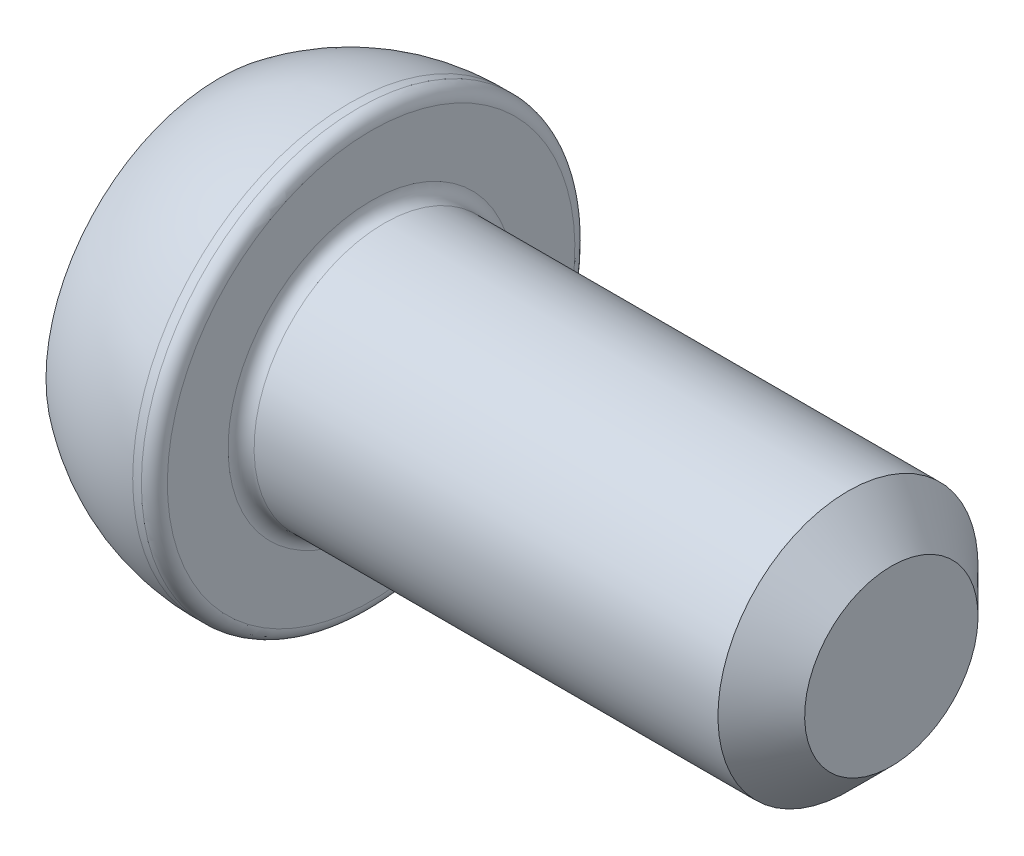
ISO-10303-21;
HEADER;
FILE_DESCRIPTION(('STEP AP214'),'2;1');
FILE_NAME('part.step','',(''),(''),'','','');
FILE_SCHEMA(('AUTOMOTIVE_DESIGN { 1 0 10303 214 1 1 1 1 }'));
ENDSEC;
DATA;
#1=APPLICATION_CONTEXT('core data for automotive mechanical design processes');
#2=APPLICATION_PROTOCOL_DEFINITION('international standard','automotive_design',2000,#1);
#3=PRODUCT_CONTEXT('',#1,'mechanical');
#4=PRODUCT('Part','Part','',(#3));
#5=PRODUCT_RELATED_PRODUCT_CATEGORY('part','',(#4));
#6=PRODUCT_DEFINITION_FORMATION('','',#4);
#7=PRODUCT_DEFINITION_CONTEXT('part definition',#1,'design');
#8=PRODUCT_DEFINITION('design','',#6,#7);
#9=PRODUCT_DEFINITION_SHAPE('','',#8);
#10=(LENGTH_UNIT() NAMED_UNIT(*) SI_UNIT(.MILLI.,.METRE.));
#11=(NAMED_UNIT(*) PLANE_ANGLE_UNIT() SI_UNIT($,.RADIAN.));
#12=(NAMED_UNIT(*) SI_UNIT($,.STERADIAN.) SOLID_ANGLE_UNIT());
#13=UNCERTAINTY_MEASURE_WITH_UNIT(LENGTH_MEASURE(1.E-05),#10,'distance_accuracy_value','');
#14=(GEOMETRIC_REPRESENTATION_CONTEXT(3) GLOBAL_UNCERTAINTY_ASSIGNED_CONTEXT((#13)) GLOBAL_UNIT_ASSIGNED_CONTEXT((#10,
#11,#12)) REPRESENTATION_CONTEXT('',''));
#15=CARTESIAN_POINT('',(0.,0.,0.));
#16=DIRECTION('',(0.,0.,1.));
#17=DIRECTION('',(1.,0.,0.));
#18=AXIS2_PLACEMENT_3D('',#15,#16,#17);
#19=CARTESIAN_POINT('',(0.,0.,0.));
#20=DIRECTION('',(-1.,0.,0.));
#21=DIRECTION('',(0.,-1.,0.));
#22=AXIS2_PLACEMENT_3D('',#19,#20,#21);
#23=PLANE('',#22);
#24=DIRECTION('',(0.,0.866025403784438,-0.5));
#25=VECTOR('',#24,1.);
#26=CARTESIAN_POINT('',(0.,0.,2.3094010767585));
#27=LINE('',#26,#25);
#28=CARTESIAN_POINT('',(0.,0.,2.3094010767585));
#29=VERTEX_POINT('',#28);
#30=CARTESIAN_POINT('',(0.,2.,1.15470053837925));
#31=VERTEX_POINT('',#30);
#32=EDGE_CURVE('E54',#29,#31,#27,.T.);
#33=ORIENTED_EDGE('',*,*,#32,.F.);
#34=DIRECTION('',(0.,0.866025403784439,0.5));
#35=VECTOR('',#34,1.);
#36=CARTESIAN_POINT('',(0.,-2.,1.15470053837925));
#37=LINE('',#36,#35);
#38=CARTESIAN_POINT('',(0.,-2.,1.15470053837925));
#39=VERTEX_POINT('',#38);
#40=EDGE_CURVE('E137',#39,#29,#37,.T.);
#41=ORIENTED_EDGE('',*,*,#40,.F.);
#42=DIRECTION('',(0.,0.,1.));
#43=VECTOR('',#42,1.);
#44=CARTESIAN_POINT('',(0.,-2.,-1.15470053837925));
#45=LINE('',#44,#43);
#46=CARTESIAN_POINT('',(0.,-2.,-1.15470053837925));
#47=VERTEX_POINT('',#46);
#48=EDGE_CURVE('E135',#47,#39,#45,.T.);
#49=ORIENTED_EDGE('',*,*,#48,.F.);
#50=DIRECTION('',(0.,-0.866025403784439,0.5));
#51=VECTOR('',#50,1.);
#52=CARTESIAN_POINT('',(0.,0.,-2.3094010767585));
#53=LINE('',#52,#51);
#54=CARTESIAN_POINT('',(0.,0.,-2.3094010767585));
#55=VERTEX_POINT('',#54);
#56=EDGE_CURVE('E102',#55,#47,#53,.T.);
#57=ORIENTED_EDGE('',*,*,#56,.F.);
#58=DIRECTION('',(0.,-0.866025403784439,-0.5));
#59=VECTOR('',#58,1.);
#60=CARTESIAN_POINT('',(0.,2.,-1.15470053837925));
#61=LINE('',#60,#59);
#62=CARTESIAN_POINT('',(0.,2.,-1.15470053837925));
#63=VERTEX_POINT('',#62);
#64=EDGE_CURVE('E131',#63,#55,#61,.T.);
#65=ORIENTED_EDGE('',*,*,#64,.F.);
#66=DIRECTION('',(0.,0.,-1.));
#67=VECTOR('',#66,1.);
#68=CARTESIAN_POINT('',(0.,2.,1.15470053837925));
#69=LINE('',#68,#67);
#70=EDGE_CURVE('E128',#31,#63,#69,.T.);
#71=ORIENTED_EDGE('',*,*,#70,.F.);
#72=EDGE_LOOP('',(#33,#41,#49,#57,#65,#71));
#73=FACE_BOUND('',#72,.T.);
#74=CARTESIAN_POINT('',(0.,0.,0.));
#75=DIRECTION('',(1.,0.,0.));
#76=DIRECTION('',(0.,1.,0.));
#77=AXIS2_PLACEMENT_3D('',#74,#75,#76);
#78=CIRCLE('',#77,4.);
#79=CARTESIAN_POINT('',(0.,4.,0.));
#80=VERTEX_POINT('',#79);
#81=EDGE_CURVE('E149',#80,#80,#78,.T.);
#82=ORIENTED_EDGE('',*,*,#81,.F.);
#83=EDGE_LOOP('',(#82));
#84=FACE_BOUND('',#83,.T.);
#85=ADVANCED_FACE('F38',(#73,#84),#23,.T.);
#86=CARTESIAN_POINT('',(3.,0.,0.));
#87=DIRECTION('',(1.,0.,0.));
#88=DIRECTION('',(0.,1.,0.));
#89=AXIS2_PLACEMENT_3D('',#86,#87,#88);
#90=SPHERICAL_SURFACE('',#89,5.);
#91=ORIENTED_EDGE('',*,*,#81,.T.);
#92=EDGE_LOOP('',(#91));
#93=FACE_BOUND('',#92,.T.);
#94=CARTESIAN_POINT('',(3.,0.,0.));
#95=DIRECTION('',(1.,0.,0.));
#96=DIRECTION('',(0.,1.,0.));
#97=AXIS2_PLACEMENT_3D('',#94,#95,#96);
#98=CIRCLE('',#97,5.);
#99=CARTESIAN_POINT('',(3.,5.,0.));
#100=VERTEX_POINT('',#99);
#101=EDGE_CURVE('E141',#100,#100,#98,.T.);
#102=ORIENTED_EDGE('',*,*,#101,.F.);
#103=EDGE_LOOP('',(#102));
#104=FACE_BOUND('',#103,.T.);
#105=ADVANCED_FACE('F178',(#93,#104),#90,.T.);
#106=CARTESIAN_POINT('',(15.5,0.,0.));
#107=DIRECTION('',(1.,0.,0.));
#108=DIRECTION('',(0.,1.,0.));
#109=AXIS2_PLACEMENT_3D('',#106,#107,#108);
#110=CYLINDRICAL_SURFACE('',#109,5.);
#111=CARTESIAN_POINT('',(3.2,0.,0.));
#112=DIRECTION('',(1.,0.,0.));
#113=DIRECTION('',(0.,1.,0.));
#114=AXIS2_PLACEMENT_3D('',#111,#112,#113);
#115=CIRCLE('',#114,5.);
#116=CARTESIAN_POINT('',(3.2,5.,0.));
#117=VERTEX_POINT('',#116);
#118=EDGE_CURVE('E161',#117,#117,#115,.F.);
#119=ORIENTED_EDGE('',*,*,#118,.T.);
#120=EDGE_LOOP('',(#119));
#121=FACE_BOUND('',#120,.T.);
#122=ORIENTED_EDGE('',*,*,#101,.T.);
#123=EDGE_LOOP('',(#122));
#124=FACE_BOUND('',#123,.T.);
#125=ADVANCED_FACE('F184',(#121,#124),#110,.T.);
#126=CARTESIAN_POINT('',(3.5,5.,0.));
#127=DIRECTION('',(1.,0.,0.));
#128=DIRECTION('',(0.,1.,0.));
#129=AXIS2_PLACEMENT_3D('',#126,#127,#128);
#130=PLANE('',#129);
#131=CARTESIAN_POINT('',(3.5,0.,0.));
#132=DIRECTION('',(1.,0.,0.));
#133=DIRECTION('',(0.,1.,0.));
#134=AXIS2_PLACEMENT_3D('',#131,#132,#133);
#135=CIRCLE('',#134,3.3);
#136=CARTESIAN_POINT('',(3.5,3.3,0.));
#137=VERTEX_POINT('',#136);
#138=EDGE_CURVE('E158',#137,#137,#135,.F.);
#139=ORIENTED_EDGE('',*,*,#138,.T.);
#140=EDGE_LOOP('',(#139));
#141=FACE_BOUND('',#140,.T.);
#142=CARTESIAN_POINT('',(3.5,0.,0.));
#143=DIRECTION('',(1.,0.,0.));
#144=DIRECTION('',(0.,1.,0.));
#145=AXIS2_PLACEMENT_3D('',#142,#143,#144);
#146=CIRCLE('',#145,4.7);
#147=CARTESIAN_POINT('',(3.5,4.7,0.));
#148=VERTEX_POINT('',#147);
#149=EDGE_CURVE('E155',#148,#148,#146,.T.);
#150=ORIENTED_EDGE('',*,*,#149,.T.);
#151=EDGE_LOOP('',(#150));
#152=FACE_BOUND('',#151,.T.);
#153=ADVANCED_FACE('F203',(#141,#152),#130,.T.);
#154=CARTESIAN_POINT('',(15.5,0.,0.));
#155=DIRECTION('',(1.,0.,0.));
#156=DIRECTION('',(0.,1.,0.));
#157=AXIS2_PLACEMENT_3D('',#154,#155,#156);
#158=CYLINDRICAL_SURFACE('',#157,3.);
#159=CARTESIAN_POINT('',(14.5,0.,0.));
#160=DIRECTION('',(1.,0.,0.));
#161=DIRECTION('',(0.,1.,0.));
#162=AXIS2_PLACEMENT_3D('',#159,#160,#161);
#163=CIRCLE('',#162,3.);
#164=CARTESIAN_POINT('',(14.5,3.,0.));
#165=VERTEX_POINT('',#164);
#166=EDGE_CURVE('E11',#165,#165,#163,.F.);
#167=ORIENTED_EDGE('',*,*,#166,.T.);
#168=EDGE_LOOP('',(#167));
#169=FACE_BOUND('',#168,.T.);
#170=CARTESIAN_POINT('',(3.8,0.,0.));
#171=DIRECTION('',(1.,0.,0.));
#172=DIRECTION('',(0.,1.,0.));
#173=AXIS2_PLACEMENT_3D('',#170,#171,#172);
#174=CIRCLE('',#173,3.);
#175=CARTESIAN_POINT('',(3.8,3.,0.));
#176=VERTEX_POINT('',#175);
#177=EDGE_CURVE('E152',#176,#176,#174,.T.);
#178=ORIENTED_EDGE('',*,*,#177,.T.);
#179=EDGE_LOOP('',(#178));
#180=FACE_BOUND('',#179,.T.);
#181=ADVANCED_FACE('F201',(#169,#180),#158,.T.);
#182=CARTESIAN_POINT('',(15.5,3.,0.));
#183=DIRECTION('',(1.,0.,0.));
#184=DIRECTION('',(0.,1.,0.));
#185=AXIS2_PLACEMENT_3D('',#182,#183,#184);
#186=PLANE('',#185);
#187=CARTESIAN_POINT('',(15.5,0.,0.));
#188=DIRECTION('',(1.,0.,0.));
#189=DIRECTION('',(0.,1.,0.));
#190=AXIS2_PLACEMENT_3D('',#187,#188,#189);
#191=CIRCLE('',#190,2.);
#192=CARTESIAN_POINT('',(15.5,2.,0.));
#193=VERTEX_POINT('',#192);
#194=EDGE_CURVE('E47',#193,#193,#191,.T.);
#195=ORIENTED_EDGE('',*,*,#194,.T.);
#196=EDGE_LOOP('',(#195));
#197=FACE_BOUND('',#196,.T.);
#198=ADVANCED_FACE('F166',(#197),#186,.T.);
#199=CARTESIAN_POINT('',(2.,0.,2.3094010767585));
#200=DIRECTION('',(0.,0.5,0.866025403784439));
#201=DIRECTION('',(0.,-0.866025403784438,0.5));
#202=AXIS2_PLACEMENT_3D('',#199,#200,#201);
#203=PLANE('',#202);
#204=ORIENTED_EDGE('',*,*,#32,.T.);
#205=DIRECTION('',(-1.,0.,0.));
#206=VECTOR('',#205,1.);
#207=CARTESIAN_POINT('',(2.,2.,1.15470053837925));
#208=LINE('',#207,#206);
#209=CARTESIAN_POINT('',(2.,2.,1.15470053837925));
#210=VERTEX_POINT('',#209);
#211=EDGE_CURVE('E84',#210,#31,#208,.T.);
#212=ORIENTED_EDGE('',*,*,#211,.F.);
#213=DIRECTION('',(0.,0.866025403784438,-0.5));
#214=VECTOR('',#213,1.);
#215=CARTESIAN_POINT('',(2.,0.,2.3094010767585));
#216=LINE('',#215,#214);
#217=CARTESIAN_POINT('',(2.,0.,2.3094010767585));
#218=VERTEX_POINT('',#217);
#219=EDGE_CURVE('E139',#218,#210,#216,.T.);
#220=ORIENTED_EDGE('',*,*,#219,.F.);
#221=DIRECTION('',(-1.,0.,0.));
#222=VECTOR('',#221,1.);
#223=CARTESIAN_POINT('',(2.,0.,2.3094010767585));
#224=LINE('',#223,#222);
#225=EDGE_CURVE('E62',#218,#29,#224,.T.);
#226=ORIENTED_EDGE('',*,*,#225,.T.);
#227=EDGE_LOOP('',(#204,#212,#220,#226));
#228=FACE_BOUND('',#227,.T.);
#229=ADVANCED_FACE('F210',(#228),#203,.F.);
#230=CARTESIAN_POINT('',(2.,-2.,1.15470053837925));
#231=DIRECTION('',(0.,-0.5,0.866025403784439));
#232=DIRECTION('',(0.,-0.866025403784439,-0.5));
#233=AXIS2_PLACEMENT_3D('',#230,#231,#232);
#234=PLANE('',#233);
#235=ORIENTED_EDGE('',*,*,#40,.T.);
#236=ORIENTED_EDGE('',*,*,#225,.F.);
#237=DIRECTION('',(0.,0.866025403784439,0.5));
#238=VECTOR('',#237,1.);
#239=CARTESIAN_POINT('',(2.,-2.,1.15470053837925));
#240=LINE('',#239,#238);
#241=CARTESIAN_POINT('',(2.,-2.,1.15470053837925));
#242=VERTEX_POINT('',#241);
#243=EDGE_CURVE('E114',#242,#218,#240,.T.);
#244=ORIENTED_EDGE('',*,*,#243,.F.);
#245=DIRECTION('',(-1.,0.,0.));
#246=VECTOR('',#245,1.);
#247=CARTESIAN_POINT('',(2.,-2.,1.15470053837925));
#248=LINE('',#247,#246);
#249=EDGE_CURVE('E106',#242,#39,#248,.T.);
#250=ORIENTED_EDGE('',*,*,#249,.T.);
#251=EDGE_LOOP('',(#235,#236,#244,#250));
#252=FACE_BOUND('',#251,.T.);
#253=ADVANCED_FACE('F269',(#252),#234,.F.);
#254=CARTESIAN_POINT('',(2.,-2.,-1.15470053837925));
#255=DIRECTION('',(0.,-1.,0.));
#256=DIRECTION('',(0.,0.,-1.));
#257=AXIS2_PLACEMENT_3D('',#254,#255,#256);
#258=PLANE('',#257);
#259=ORIENTED_EDGE('',*,*,#48,.T.);
#260=ORIENTED_EDGE('',*,*,#249,.F.);
#261=DIRECTION('',(0.,0.,1.));
#262=VECTOR('',#261,1.);
#263=CARTESIAN_POINT('',(2.,-2.,-1.15470053837925));
#264=LINE('',#263,#262);
#265=CARTESIAN_POINT('',(2.,-2.,-1.15470053837925));
#266=VERTEX_POINT('',#265);
#267=EDGE_CURVE('E110',#266,#242,#264,.T.);
#268=ORIENTED_EDGE('',*,*,#267,.F.);
#269=DIRECTION('',(-1.,0.,0.));
#270=VECTOR('',#269,1.);
#271=CARTESIAN_POINT('',(2.,-2.,-1.15470053837925));
#272=LINE('',#271,#270);
#273=EDGE_CURVE('E95',#266,#47,#272,.T.);
#274=ORIENTED_EDGE('',*,*,#273,.T.);
#275=EDGE_LOOP('',(#259,#260,#268,#274));
#276=FACE_BOUND('',#275,.T.);
#277=ADVANCED_FACE('F111',(#276),#258,.F.);
#278=CARTESIAN_POINT('',(2.,0.,-2.3094010767585));
#279=DIRECTION('',(0.,-0.5,-0.866025403784439));
#280=DIRECTION('',(0.,0.866025403784439,-0.5));
#281=AXIS2_PLACEMENT_3D('',#278,#279,#280);
#282=PLANE('',#281);
#283=ORIENTED_EDGE('',*,*,#56,.T.);
#284=ORIENTED_EDGE('',*,*,#273,.F.);
#285=DIRECTION('',(0.,-0.866025403784439,0.5));
#286=VECTOR('',#285,1.);
#287=CARTESIAN_POINT('',(2.,0.,-2.3094010767585));
#288=LINE('',#287,#286);
#289=CARTESIAN_POINT('',(2.,0.,-2.3094010767585));
#290=VERTEX_POINT('',#289);
#291=EDGE_CURVE('E99',#290,#266,#288,.T.);
#292=ORIENTED_EDGE('',*,*,#291,.F.);
#293=DIRECTION('',(-1.,0.,0.));
#294=VECTOR('',#293,1.);
#295=CARTESIAN_POINT('',(2.,0.,-2.3094010767585));
#296=LINE('',#295,#294);
#297=EDGE_CURVE('E107',#290,#55,#296,.T.);
#298=ORIENTED_EDGE('',*,*,#297,.T.);
#299=EDGE_LOOP('',(#283,#284,#292,#298));
#300=FACE_BOUND('',#299,.T.);
#301=ADVANCED_FACE('F97',(#300),#282,.F.);
#302=CARTESIAN_POINT('',(2.,2.,-1.15470053837925));
#303=DIRECTION('',(0.,0.5,-0.866025403784439));
#304=DIRECTION('',(0.,0.866025403784439,0.5));
#305=AXIS2_PLACEMENT_3D('',#302,#303,#304);
#306=PLANE('',#305);
#307=ORIENTED_EDGE('',*,*,#64,.T.);
#308=ORIENTED_EDGE('',*,*,#297,.F.);
#309=DIRECTION('',(0.,-0.866025403784439,-0.5));
#310=VECTOR('',#309,1.);
#311=CARTESIAN_POINT('',(2.,2.,-1.15470053837925));
#312=LINE('',#311,#310);
#313=CARTESIAN_POINT('',(2.,2.,-1.15470053837925));
#314=VERTEX_POINT('',#313);
#315=EDGE_CURVE('E120',#314,#290,#312,.T.);
#316=ORIENTED_EDGE('',*,*,#315,.F.);
#317=DIRECTION('',(-1.,0.,0.));
#318=VECTOR('',#317,1.);
#319=CARTESIAN_POINT('',(2.,2.,-1.15470053837925));
#320=LINE('',#319,#318);
#321=EDGE_CURVE('E144',#314,#63,#320,.T.);
#322=ORIENTED_EDGE('',*,*,#321,.T.);
#323=EDGE_LOOP('',(#307,#308,#316,#322));
#324=FACE_BOUND('',#323,.T.);
#325=ADVANCED_FACE('F286',(#324),#306,.F.);
#326=CARTESIAN_POINT('',(2.,2.,1.15470053837925));
#327=DIRECTION('',(0.,1.,0.));
#328=DIRECTION('',(0.,0.,1.));
#329=AXIS2_PLACEMENT_3D('',#326,#327,#328);
#330=PLANE('',#329);
#331=ORIENTED_EDGE('',*,*,#70,.T.);
#332=ORIENTED_EDGE('',*,*,#321,.F.);
#333=DIRECTION('',(0.,0.,-1.));
#334=VECTOR('',#333,1.);
#335=CARTESIAN_POINT('',(2.,2.,1.15470053837925));
#336=LINE('',#335,#334);
#337=EDGE_CURVE('E122',#210,#314,#336,.T.);
#338=ORIENTED_EDGE('',*,*,#337,.F.);
#339=ORIENTED_EDGE('',*,*,#211,.T.);
#340=EDGE_LOOP('',(#331,#332,#338,#339));
#341=FACE_BOUND('',#340,.T.);
#342=ADVANCED_FACE('F195',(#341),#330,.F.);
#343=CARTESIAN_POINT('',(2.,0.,0.));
#344=DIRECTION('',(-1.,0.,0.));
#345=DIRECTION('',(0.,0.,1.));
#346=AXIS2_PLACEMENT_3D('',#343,#344,#345);
#347=PLANE('',#346);
#348=ORIENTED_EDGE('',*,*,#219,.T.);
#349=ORIENTED_EDGE('',*,*,#337,.T.);
#350=ORIENTED_EDGE('',*,*,#315,.T.);
#351=ORIENTED_EDGE('',*,*,#291,.T.);
#352=ORIENTED_EDGE('',*,*,#267,.T.);
#353=ORIENTED_EDGE('',*,*,#243,.T.);
#354=EDGE_LOOP('',(#348,#349,#350,#351,#352,#353));
#355=FACE_BOUND('',#354,.T.);
#356=ADVANCED_FACE('F117',(#355),#347,.T.);
#357=CARTESIAN_POINT('',(3.8,0.,0.));
#358=DIRECTION('',(1.,0.,0.));
#359=DIRECTION('',(0.,1.,0.));
#360=AXIS2_PLACEMENT_3D('',#357,#358,#359);
#361=TOROIDAL_SURFACE('',#360,3.3,0.3);
#362=ORIENTED_EDGE('',*,*,#138,.F.);
#363=EDGE_LOOP('',(#362));
#364=FACE_BOUND('',#363,.T.);
#365=ORIENTED_EDGE('',*,*,#177,.F.);
#366=EDGE_LOOP('',(#365));
#367=FACE_BOUND('',#366,.T.);
#368=ADVANCED_FACE('F174',(#364,#367),#361,.F.);
#369=CARTESIAN_POINT('',(3.2,0.,0.));
#370=DIRECTION('',(1.,0.,0.));
#371=DIRECTION('',(0.,1.,0.));
#372=AXIS2_PLACEMENT_3D('',#369,#370,#371);
#373=TOROIDAL_SURFACE('',#372,4.7,0.3);
#374=ORIENTED_EDGE('',*,*,#118,.F.);
#375=EDGE_LOOP('',(#374));
#376=FACE_BOUND('',#375,.T.);
#377=ORIENTED_EDGE('',*,*,#149,.F.);
#378=EDGE_LOOP('',(#377));
#379=FACE_BOUND('',#378,.T.);
#380=ADVANCED_FACE('F169',(#376,#379),#373,.T.);
#381=CARTESIAN_POINT('',(15.5,0.,0.));
#382=DIRECTION('',(-1.,0.,0.));
#383=DIRECTION('',(0.,-1.,0.));
#384=AXIS2_PLACEMENT_3D('',#381,#382,#383);
#385=CONICAL_SURFACE('',#384,2.,0.785398163397446);
#386=ORIENTED_EDGE('',*,*,#166,.F.);
#387=EDGE_LOOP('',(#386));
#388=FACE_BOUND('',#387,.T.);
#389=ORIENTED_EDGE('',*,*,#194,.F.);
#390=EDGE_LOOP('',(#389));
#391=FACE_BOUND('',#390,.T.);
#392=ADVANCED_FACE('F41',(#388,#391),#385,.T.);
#393=CLOSED_SHELL('',(#85,#105,#125,#153,#181,#198,#229,#253,#277,#301,#325,#342,#356,#368,#380,#392));
#394=MANIFOLD_SOLID_BREP('B2',#393);
#395=ADVANCED_BREP_SHAPE_REPRESENTATION('',(#18,#394),#14);
#396=SHAPE_DEFINITION_REPRESENTATION(#9,#395);
ENDSEC;
END-ISO-10303-21;
